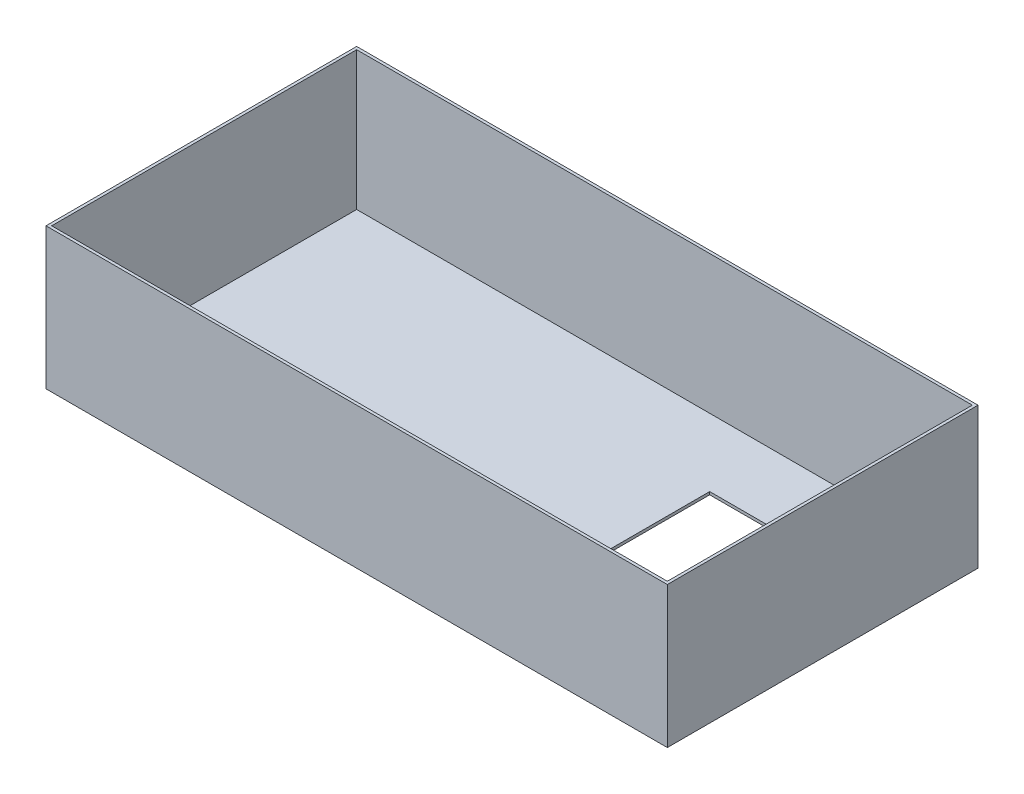
ISO-10303-21;
HEADER;
FILE_DESCRIPTION(('STEP AP214'),'2;1');
FILE_NAME('part.step','',(''),(''),'','','');
FILE_SCHEMA(('AUTOMOTIVE_DESIGN { 1 0 10303 214 1 1 1 1 }'));
ENDSEC;
DATA;
#1=APPLICATION_CONTEXT('core data for automotive mechanical design processes');
#2=APPLICATION_PROTOCOL_DEFINITION('international standard','automotive_design',2000,#1);
#3=PRODUCT_CONTEXT('',#1,'mechanical');
#4=PRODUCT('Part','Part','',(#3));
#5=PRODUCT_RELATED_PRODUCT_CATEGORY('part','',(#4));
#6=PRODUCT_DEFINITION_FORMATION('','',#4);
#7=PRODUCT_DEFINITION_CONTEXT('part definition',#1,'design');
#8=PRODUCT_DEFINITION('design','',#6,#7);
#9=PRODUCT_DEFINITION_SHAPE('','',#8);
#10=(LENGTH_UNIT() NAMED_UNIT(*) SI_UNIT(.MILLI.,.METRE.));
#11=(NAMED_UNIT(*) PLANE_ANGLE_UNIT() SI_UNIT($,.RADIAN.));
#12=(NAMED_UNIT(*) SI_UNIT($,.STERADIAN.) SOLID_ANGLE_UNIT());
#13=UNCERTAINTY_MEASURE_WITH_UNIT(LENGTH_MEASURE(1.E-05),#10,'distance_accuracy_value','');
#14=(GEOMETRIC_REPRESENTATION_CONTEXT(3) GLOBAL_UNCERTAINTY_ASSIGNED_CONTEXT((#13)) GLOBAL_UNIT_ASSIGNED_CONTEXT((#10,
#11,#12)) REPRESENTATION_CONTEXT('',''));
#15=CARTESIAN_POINT('',(0.,0.,0.));
#16=DIRECTION('',(0.,0.,1.));
#17=DIRECTION('',(1.,0.,0.));
#18=AXIS2_PLACEMENT_3D('',#15,#16,#17);
#19=CARTESIAN_POINT('',(0.,500.,0.));
#20=DIRECTION('',(-1.,0.,0.));
#21=DIRECTION('',(0.,0.,1.));
#22=AXIS2_PLACEMENT_3D('',#19,#20,#21);
#23=PLANE('',#22);
#24=DIRECTION('',(0.,0.,-1.));
#25=VECTOR('',#24,1.);
#26=CARTESIAN_POINT('',(0.,0.,0.));
#27=LINE('',#26,#25);
#28=CARTESIAN_POINT('',(0.,0.,0.));
#29=VERTEX_POINT('',#28);
#30=CARTESIAN_POINT('',(0.,0.,-1100.));
#31=VERTEX_POINT('',#30);
#32=EDGE_CURVE('E153',#29,#31,#27,.T.);
#33=ORIENTED_EDGE('',*,*,#32,.T.);
#34=DIRECTION('',(0.,-1.,0.));
#35=VECTOR('',#34,1.);
#36=CARTESIAN_POINT('',(0.,500.,-1100.));
#37=LINE('',#36,#35);
#38=CARTESIAN_POINT('',(0.,500.,-1100.));
#39=VERTEX_POINT('',#38);
#40=EDGE_CURVE('E203',#39,#31,#37,.T.);
#41=ORIENTED_EDGE('',*,*,#40,.F.);
#42=DIRECTION('',(0.,0.,-1.));
#43=VECTOR('',#42,1.);
#44=CARTESIAN_POINT('',(0.,500.,0.));
#45=LINE('',#44,#43);
#46=CARTESIAN_POINT('',(0.,500.,0.));
#47=VERTEX_POINT('',#46);
#48=EDGE_CURVE('E185',#47,#39,#45,.T.);
#49=ORIENTED_EDGE('',*,*,#48,.F.);
#50=DIRECTION('',(0.,-1.,0.));
#51=VECTOR('',#50,1.);
#52=CARTESIAN_POINT('',(0.,500.,0.));
#53=LINE('',#52,#51);
#54=EDGE_CURVE('E194',#47,#29,#53,.T.);
#55=ORIENTED_EDGE('',*,*,#54,.T.);
#56=EDGE_LOOP('',(#33,#41,#49,#55));
#57=FACE_BOUND('',#56,.T.);
#58=ADVANCED_FACE('F31',(#57),#23,.F.);
#59=CARTESIAN_POINT('',(0.,500.,-1100.));
#60=DIRECTION('',(0.,0.,1.));
#61=DIRECTION('',(1.,0.,0.));
#62=AXIS2_PLACEMENT_3D('',#59,#60,#61);
#63=PLANE('',#62);
#64=DIRECTION('',(-1.,0.,0.));
#65=VECTOR('',#64,1.);
#66=CARTESIAN_POINT('',(0.,0.,-1100.));
#67=LINE('',#66,#65);
#68=CARTESIAN_POINT('',(-2200.,0.,-1100.));
#69=VERTEX_POINT('',#68);
#70=EDGE_CURVE('E179',#31,#69,#67,.T.);
#71=ORIENTED_EDGE('',*,*,#70,.T.);
#72=DIRECTION('',(0.,-1.,0.));
#73=VECTOR('',#72,1.);
#74=CARTESIAN_POINT('',(-2200.,500.,-1100.));
#75=LINE('',#74,#73);
#76=CARTESIAN_POINT('',(-2200.,500.,-1100.));
#77=VERTEX_POINT('',#76);
#78=EDGE_CURVE('E200',#77,#69,#75,.T.);
#79=ORIENTED_EDGE('',*,*,#78,.F.);
#80=DIRECTION('',(-1.,0.,0.));
#81=VECTOR('',#80,1.);
#82=CARTESIAN_POINT('',(0.,500.,-1100.));
#83=LINE('',#82,#81);
#84=EDGE_CURVE('E188',#39,#77,#83,.T.);
#85=ORIENTED_EDGE('',*,*,#84,.F.);
#86=ORIENTED_EDGE('',*,*,#40,.T.);
#87=EDGE_LOOP('',(#71,#79,#85,#86));
#88=FACE_BOUND('',#87,.T.);
#89=ADVANCED_FACE('F229',(#88),#63,.F.);
#90=CARTESIAN_POINT('',(-2200.,500.,2.69413397840923E-13));
#91=DIRECTION('',(1.,0.,0.));
#92=DIRECTION('',(0.,0.,-1.));
#93=AXIS2_PLACEMENT_3D('',#90,#91,#92);
#94=PLANE('',#93);
#95=DIRECTION('',(0.,0.,1.));
#96=VECTOR('',#95,1.);
#97=CARTESIAN_POINT('',(-2200.,0.,2.69413397840923E-13));
#98=LINE('',#97,#96);
#99=CARTESIAN_POINT('',(-2200.,0.,2.69413397840923E-13));
#100=VERTEX_POINT('',#99);
#101=EDGE_CURVE('E181',#69,#100,#98,.T.);
#102=ORIENTED_EDGE('',*,*,#101,.T.);
#103=DIRECTION('',(0.,-1.,0.));
#104=VECTOR('',#103,1.);
#105=CARTESIAN_POINT('',(-2200.,500.,2.69413397840923E-13));
#106=LINE('',#105,#104);
#107=CARTESIAN_POINT('',(-2200.,500.,2.69413397840923E-13));
#108=VERTEX_POINT('',#107);
#109=EDGE_CURVE('E197',#108,#100,#106,.T.);
#110=ORIENTED_EDGE('',*,*,#109,.F.);
#111=DIRECTION('',(0.,0.,1.));
#112=VECTOR('',#111,1.);
#113=CARTESIAN_POINT('',(-2200.,500.,2.69413397840923E-13));
#114=LINE('',#113,#112);
#115=EDGE_CURVE('E190',#77,#108,#114,.T.);
#116=ORIENTED_EDGE('',*,*,#115,.F.);
#117=ORIENTED_EDGE('',*,*,#78,.T.);
#118=EDGE_LOOP('',(#102,#110,#116,#117));
#119=FACE_BOUND('',#118,.T.);
#120=ADVANCED_FACE('F234',(#119),#94,.F.);
#121=CARTESIAN_POINT('',(0.,500.,0.));
#122=DIRECTION('',(0.,0.,-1.));
#123=DIRECTION('',(-1.,0.,0.));
#124=AXIS2_PLACEMENT_3D('',#121,#122,#123);
#125=PLANE('',#124);
#126=DIRECTION('',(1.,0.,0.));
#127=VECTOR('',#126,1.);
#128=CARTESIAN_POINT('',(0.,0.,0.));
#129=LINE('',#128,#127);
#130=EDGE_CURVE('E183',#100,#29,#129,.T.);
#131=ORIENTED_EDGE('',*,*,#130,.T.);
#132=ORIENTED_EDGE('',*,*,#54,.F.);
#133=DIRECTION('',(1.,0.,0.));
#134=VECTOR('',#133,1.);
#135=CARTESIAN_POINT('',(0.,500.,0.));
#136=LINE('',#135,#134);
#137=EDGE_CURVE('E192',#108,#47,#136,.T.);
#138=ORIENTED_EDGE('',*,*,#137,.F.);
#139=ORIENTED_EDGE('',*,*,#109,.T.);
#140=EDGE_LOOP('',(#131,#132,#138,#139));
#141=FACE_BOUND('',#140,.T.);
#142=ADVANCED_FACE('F249',(#141),#125,.F.);
#143=CARTESIAN_POINT('',(0.,500.,-1100.));
#144=DIRECTION('',(0.,1.,0.));
#145=DIRECTION('',(0.,0.,1.));
#146=AXIS2_PLACEMENT_3D('',#143,#144,#145);
#147=PLANE('',#146);
#148=DIRECTION('',(0.,0.,-1.));
#149=VECTOR('',#148,1.);
#150=CARTESIAN_POINT('',(-10.,500.,0.));
#151=LINE('',#150,#149);
#152=CARTESIAN_POINT('',(-10.,500.,-10.));
#153=VERTEX_POINT('',#152);
#154=CARTESIAN_POINT('',(-10.,500.,-1090.));
#155=VERTEX_POINT('',#154);
#156=EDGE_CURVE('E169',#153,#155,#151,.T.);
#157=ORIENTED_EDGE('',*,*,#156,.F.);
#158=DIRECTION('',(1.,0.,0.));
#159=VECTOR('',#158,1.);
#160=CARTESIAN_POINT('',(0.,500.,-10.));
#161=LINE('',#160,#159);
#162=CARTESIAN_POINT('',(-2190.,500.,-9.99999999999973));
#163=VERTEX_POINT('',#162);
#164=EDGE_CURVE('E159',#163,#153,#161,.T.);
#165=ORIENTED_EDGE('',*,*,#164,.F.);
#166=DIRECTION('',(0.,0.,1.));
#167=VECTOR('',#166,1.);
#168=CARTESIAN_POINT('',(-2190.,500.,2.69413397840923E-13));
#169=LINE('',#168,#167);
#170=CARTESIAN_POINT('',(-2190.,500.,-1090.));
#171=VERTEX_POINT('',#170);
#172=EDGE_CURVE('E173',#171,#163,#169,.T.);
#173=ORIENTED_EDGE('',*,*,#172,.F.);
#174=DIRECTION('',(-1.,0.,0.));
#175=VECTOR('',#174,1.);
#176=CARTESIAN_POINT('',(0.,500.,-1090.));
#177=LINE('',#176,#175);
#178=EDGE_CURVE('E171',#155,#171,#177,.T.);
#179=ORIENTED_EDGE('',*,*,#178,.F.);
#180=EDGE_LOOP('',(#157,#165,#173,#179));
#181=FACE_BOUND('',#180,.T.);
#182=ORIENTED_EDGE('',*,*,#48,.T.);
#183=ORIENTED_EDGE('',*,*,#84,.T.);
#184=ORIENTED_EDGE('',*,*,#115,.T.);
#185=ORIENTED_EDGE('',*,*,#137,.T.);
#186=EDGE_LOOP('',(#182,#183,#184,#185));
#187=FACE_BOUND('',#186,.T.);
#188=ADVANCED_FACE('F245',(#181,#187),#147,.T.);
#189=CARTESIAN_POINT('',(0.,0.,-1100.));
#190=DIRECTION('',(0.,1.,0.));
#191=DIRECTION('',(0.,0.,1.));
#192=AXIS2_PLACEMENT_3D('',#189,#190,#191);
#193=PLANE('',#192);
#194=DIRECTION('',(-1.,0.,0.));
#195=VECTOR('',#194,1.);
#196=CARTESIAN_POINT('',(-100.,0.,-250.));
#197=LINE('',#196,#195);
#198=CARTESIAN_POINT('',(-100.,0.,-250.));
#199=VERTEX_POINT('',#198);
#200=CARTESIAN_POINT('',(-700.,0.,-250.));
#201=VERTEX_POINT('',#200);
#202=EDGE_CURVE('E130',#199,#201,#197,.T.);
#203=ORIENTED_EDGE('',*,*,#202,.F.);
#204=DIRECTION('',(0.,0.,1.));
#205=VECTOR('',#204,1.);
#206=CARTESIAN_POINT('',(-100.,0.,-250.));
#207=LINE('',#206,#205);
#208=CARTESIAN_POINT('',(-99.9999999999999,0.,-850.));
#209=VERTEX_POINT('',#208);
#210=EDGE_CURVE('E45',#209,#199,#207,.T.);
#211=ORIENTED_EDGE('',*,*,#210,.F.);
#212=DIRECTION('',(1.,0.,0.));
#213=VECTOR('',#212,1.);
#214=CARTESIAN_POINT('',(-99.9999999999999,0.,-850.));
#215=LINE('',#214,#213);
#216=CARTESIAN_POINT('',(-700.,0.,-850.));
#217=VERTEX_POINT('',#216);
#218=EDGE_CURVE('E137',#217,#209,#215,.T.);
#219=ORIENTED_EDGE('',*,*,#218,.F.);
#220=DIRECTION('',(0.,0.,-1.));
#221=VECTOR('',#220,1.);
#222=CARTESIAN_POINT('',(-700.,0.,-250.));
#223=LINE('',#222,#221);
#224=EDGE_CURVE('E121',#201,#217,#223,.T.);
#225=ORIENTED_EDGE('',*,*,#224,.F.);
#226=EDGE_LOOP('',(#203,#211,#219,#225));
#227=FACE_BOUND('',#226,.T.);
#228=ORIENTED_EDGE('',*,*,#32,.F.);
#229=ORIENTED_EDGE('',*,*,#130,.F.);
#230=ORIENTED_EDGE('',*,*,#101,.F.);
#231=ORIENTED_EDGE('',*,*,#70,.F.);
#232=EDGE_LOOP('',(#228,#229,#230,#231));
#233=FACE_BOUND('',#232,.T.);
#234=ADVANCED_FACE('F134',(#227,#233),#193,.F.);
#235=CARTESIAN_POINT('',(-10.,500.,0.));
#236=DIRECTION('',(-1.,0.,0.));
#237=DIRECTION('',(0.,0.,1.));
#238=AXIS2_PLACEMENT_3D('',#235,#236,#237);
#239=PLANE('',#238);
#240=DIRECTION('',(0.,0.,-1.));
#241=VECTOR('',#240,1.);
#242=CARTESIAN_POINT('',(-10.,10.,0.));
#243=LINE('',#242,#241);
#244=CARTESIAN_POINT('',(-10.,10.,-10.));
#245=VERTEX_POINT('',#244);
#246=CARTESIAN_POINT('',(-10.,10.,-1090.));
#247=VERTEX_POINT('',#246);
#248=EDGE_CURVE('E144',#245,#247,#243,.T.);
#249=ORIENTED_EDGE('',*,*,#248,.F.);
#250=DIRECTION('',(0.,-1.,0.));
#251=VECTOR('',#250,1.);
#252=CARTESIAN_POINT('',(-10.,500.,-10.));
#253=LINE('',#252,#251);
#254=EDGE_CURVE('E155',#153,#245,#253,.T.);
#255=ORIENTED_EDGE('',*,*,#254,.F.);
#256=ORIENTED_EDGE('',*,*,#156,.T.);
#257=DIRECTION('',(0.,-1.,0.));
#258=VECTOR('',#257,1.);
#259=CARTESIAN_POINT('',(-10.,500.,-1090.));
#260=LINE('',#259,#258);
#261=EDGE_CURVE('E150',#155,#247,#260,.T.);
#262=ORIENTED_EDGE('',*,*,#261,.T.);
#263=EDGE_LOOP('',(#249,#255,#256,#262));
#264=FACE_BOUND('',#263,.T.);
#265=ADVANCED_FACE('F262',(#264),#239,.T.);
#266=CARTESIAN_POINT('',(0.,500.,-1090.));
#267=DIRECTION('',(0.,0.,1.));
#268=DIRECTION('',(1.,0.,0.));
#269=AXIS2_PLACEMENT_3D('',#266,#267,#268);
#270=PLANE('',#269);
#271=DIRECTION('',(-1.,0.,0.));
#272=VECTOR('',#271,1.);
#273=CARTESIAN_POINT('',(0.,10.,-1090.));
#274=LINE('',#273,#272);
#275=CARTESIAN_POINT('',(-2190.,10.,-1090.));
#276=VERTEX_POINT('',#275);
#277=EDGE_CURVE('E149',#247,#276,#274,.T.);
#278=ORIENTED_EDGE('',*,*,#277,.F.);
#279=ORIENTED_EDGE('',*,*,#261,.F.);
#280=ORIENTED_EDGE('',*,*,#178,.T.);
#281=DIRECTION('',(0.,-1.,0.));
#282=VECTOR('',#281,1.);
#283=CARTESIAN_POINT('',(-2190.,500.,-1090.));
#284=LINE('',#283,#282);
#285=EDGE_CURVE('E154',#171,#276,#284,.T.);
#286=ORIENTED_EDGE('',*,*,#285,.T.);
#287=EDGE_LOOP('',(#278,#279,#280,#286));
#288=FACE_BOUND('',#287,.T.);
#289=ADVANCED_FACE('F270',(#288),#270,.T.);
#290=CARTESIAN_POINT('',(-2190.,500.,2.69413397840923E-13));
#291=DIRECTION('',(1.,0.,0.));
#292=DIRECTION('',(0.,0.,-1.));
#293=AXIS2_PLACEMENT_3D('',#290,#291,#292);
#294=PLANE('',#293);
#295=DIRECTION('',(0.,0.,1.));
#296=VECTOR('',#295,1.);
#297=CARTESIAN_POINT('',(-2190.,10.,2.69413397840923E-13));
#298=LINE('',#297,#296);
#299=CARTESIAN_POINT('',(-2190.,10.,-9.99999999999973));
#300=VERTEX_POINT('',#299);
#301=EDGE_CURVE('E161',#276,#300,#298,.T.);
#302=ORIENTED_EDGE('',*,*,#301,.F.);
#303=ORIENTED_EDGE('',*,*,#285,.F.);
#304=ORIENTED_EDGE('',*,*,#172,.T.);
#305=DIRECTION('',(0.,-1.,0.));
#306=VECTOR('',#305,1.);
#307=CARTESIAN_POINT('',(-2190.,500.,-9.99999999999973));
#308=LINE('',#307,#306);
#309=EDGE_CURVE('E158',#163,#300,#308,.T.);
#310=ORIENTED_EDGE('',*,*,#309,.T.);
#311=EDGE_LOOP('',(#302,#303,#304,#310));
#312=FACE_BOUND('',#311,.T.);
#313=ADVANCED_FACE('F266',(#312),#294,.T.);
#314=CARTESIAN_POINT('',(0.,500.,-10.));
#315=DIRECTION('',(0.,0.,-1.));
#316=DIRECTION('',(-1.,0.,0.));
#317=AXIS2_PLACEMENT_3D('',#314,#315,#316);
#318=PLANE('',#317);
#319=DIRECTION('',(1.,0.,0.));
#320=VECTOR('',#319,1.);
#321=CARTESIAN_POINT('',(0.,10.,-10.));
#322=LINE('',#321,#320);
#323=EDGE_CURVE('E165',#300,#245,#322,.T.);
#324=ORIENTED_EDGE('',*,*,#323,.F.);
#325=ORIENTED_EDGE('',*,*,#309,.F.);
#326=ORIENTED_EDGE('',*,*,#164,.T.);
#327=ORIENTED_EDGE('',*,*,#254,.T.);
#328=EDGE_LOOP('',(#324,#325,#326,#327));
#329=FACE_BOUND('',#328,.T.);
#330=ADVANCED_FACE('F224',(#329),#318,.T.);
#331=CARTESIAN_POINT('',(0.,10.,-1100.));
#332=DIRECTION('',(0.,1.,0.));
#333=DIRECTION('',(0.,0.,1.));
#334=AXIS2_PLACEMENT_3D('',#331,#332,#333);
#335=PLANE('',#334);
#336=DIRECTION('',(0.,0.,-1.));
#337=VECTOR('',#336,1.);
#338=CARTESIAN_POINT('',(-99.9999999999999,10.,-1100.));
#339=LINE('',#338,#337);
#340=CARTESIAN_POINT('',(-100.,10.,-250.));
#341=VERTEX_POINT('',#340);
#342=CARTESIAN_POINT('',(-99.9999999999999,10.,-850.));
#343=VERTEX_POINT('',#342);
#344=EDGE_CURVE('E11',#341,#343,#339,.T.);
#345=ORIENTED_EDGE('',*,*,#344,.F.);
#346=DIRECTION('',(1.,0.,0.));
#347=VECTOR('',#346,1.);
#348=CARTESIAN_POINT('',(0.,10.,-250.));
#349=LINE('',#348,#347);
#350=CARTESIAN_POINT('',(-700.,10.,-250.));
#351=VERTEX_POINT('',#350);
#352=EDGE_CURVE('E206',#351,#341,#349,.T.);
#353=ORIENTED_EDGE('',*,*,#352,.F.);
#354=DIRECTION('',(0.,0.,1.));
#355=VECTOR('',#354,1.);
#356=CARTESIAN_POINT('',(-700.,10.,-1100.));
#357=LINE('',#356,#355);
#358=CARTESIAN_POINT('',(-700.,10.,-850.));
#359=VERTEX_POINT('',#358);
#360=EDGE_CURVE('E124',#359,#351,#357,.T.);
#361=ORIENTED_EDGE('',*,*,#360,.F.);
#362=DIRECTION('',(-1.,0.,0.));
#363=VECTOR('',#362,1.);
#364=CARTESIAN_POINT('',(0.,10.,-850.));
#365=LINE('',#364,#363);
#366=EDGE_CURVE('E38',#343,#359,#365,.T.);
#367=ORIENTED_EDGE('',*,*,#366,.F.);
#368=EDGE_LOOP('',(#345,#353,#361,#367));
#369=FACE_BOUND('',#368,.T.);
#370=ORIENTED_EDGE('',*,*,#248,.T.);
#371=ORIENTED_EDGE('',*,*,#277,.T.);
#372=ORIENTED_EDGE('',*,*,#301,.T.);
#373=ORIENTED_EDGE('',*,*,#323,.T.);
#374=EDGE_LOOP('',(#370,#371,#372,#373));
#375=FACE_BOUND('',#374,.T.);
#376=ADVANCED_FACE('F214',(#369,#375),#335,.T.);
#377=CARTESIAN_POINT('',(-100.,400.,-250.));
#378=DIRECTION('',(1.,0.,0.));
#379=DIRECTION('',(0.,0.,-1.));
#380=AXIS2_PLACEMENT_3D('',#377,#378,#379);
#381=PLANE('',#380);
#382=ORIENTED_EDGE('',*,*,#344,.T.);
#383=DIRECTION('',(0.,-1.,0.));
#384=VECTOR('',#383,1.);
#385=CARTESIAN_POINT('',(-99.9999999999999,400.,-850.));
#386=LINE('',#385,#384);
#387=EDGE_CURVE('E142',#343,#209,#386,.T.);
#388=ORIENTED_EDGE('',*,*,#387,.T.);
#389=ORIENTED_EDGE('',*,*,#210,.T.);
#390=DIRECTION('',(0.,-1.,0.));
#391=VECTOR('',#390,1.);
#392=CARTESIAN_POINT('',(-100.,400.,-250.));
#393=LINE('',#392,#391);
#394=EDGE_CURVE('E127',#341,#199,#393,.T.);
#395=ORIENTED_EDGE('',*,*,#394,.F.);
#396=EDGE_LOOP('',(#382,#388,#389,#395));
#397=FACE_BOUND('',#396,.T.);
#398=ADVANCED_FACE('F216',(#397),#381,.F.);
#399=CARTESIAN_POINT('',(-99.9999999999999,400.,-850.));
#400=DIRECTION('',(0.,0.,-1.));
#401=DIRECTION('',(-1.,0.,0.));
#402=AXIS2_PLACEMENT_3D('',#399,#400,#401);
#403=PLANE('',#402);
#404=ORIENTED_EDGE('',*,*,#366,.T.);
#405=DIRECTION('',(0.,-1.,0.));
#406=VECTOR('',#405,1.);
#407=CARTESIAN_POINT('',(-700.,400.,-850.));
#408=LINE('',#407,#406);
#409=EDGE_CURVE('E126',#359,#217,#408,.T.);
#410=ORIENTED_EDGE('',*,*,#409,.T.);
#411=ORIENTED_EDGE('',*,*,#218,.T.);
#412=ORIENTED_EDGE('',*,*,#387,.F.);
#413=EDGE_LOOP('',(#404,#410,#411,#412));
#414=FACE_BOUND('',#413,.T.);
#415=ADVANCED_FACE('F211',(#414),#403,.F.);
#416=CARTESIAN_POINT('',(-700.,400.,-250.));
#417=DIRECTION('',(-1.,0.,0.));
#418=DIRECTION('',(0.,0.,1.));
#419=AXIS2_PLACEMENT_3D('',#416,#417,#418);
#420=PLANE('',#419);
#421=ORIENTED_EDGE('',*,*,#360,.T.);
#422=DIRECTION('',(0.,-1.,0.));
#423=VECTOR('',#422,1.);
#424=CARTESIAN_POINT('',(-700.,400.,-250.));
#425=LINE('',#424,#423);
#426=EDGE_CURVE('E53',#351,#201,#425,.T.);
#427=ORIENTED_EDGE('',*,*,#426,.T.);
#428=ORIENTED_EDGE('',*,*,#224,.T.);
#429=ORIENTED_EDGE('',*,*,#409,.F.);
#430=EDGE_LOOP('',(#421,#427,#428,#429));
#431=FACE_BOUND('',#430,.T.);
#432=ADVANCED_FACE('F118',(#431),#420,.F.);
#433=CARTESIAN_POINT('',(-100.,400.,-250.));
#434=DIRECTION('',(0.,0.,1.));
#435=DIRECTION('',(1.,0.,0.));
#436=AXIS2_PLACEMENT_3D('',#433,#434,#435);
#437=PLANE('',#436);
#438=ORIENTED_EDGE('',*,*,#352,.T.);
#439=ORIENTED_EDGE('',*,*,#394,.T.);
#440=ORIENTED_EDGE('',*,*,#202,.T.);
#441=ORIENTED_EDGE('',*,*,#426,.F.);
#442=EDGE_LOOP('',(#438,#439,#440,#441));
#443=FACE_BOUND('',#442,.T.);
#444=ADVANCED_FACE('F131',(#443),#437,.F.);
#445=CLOSED_SHELL('',(#58,#89,#120,#142,#188,#234,#265,#289,#313,#330,#376,#398,#415,#432,#444));
#446=MANIFOLD_SOLID_BREP('B2',#445);
#447=ADVANCED_BREP_SHAPE_REPRESENTATION('',(#18,#446),#14);
#448=SHAPE_DEFINITION_REPRESENTATION(#9,#447);
ENDSEC;
END-ISO-10303-21;
